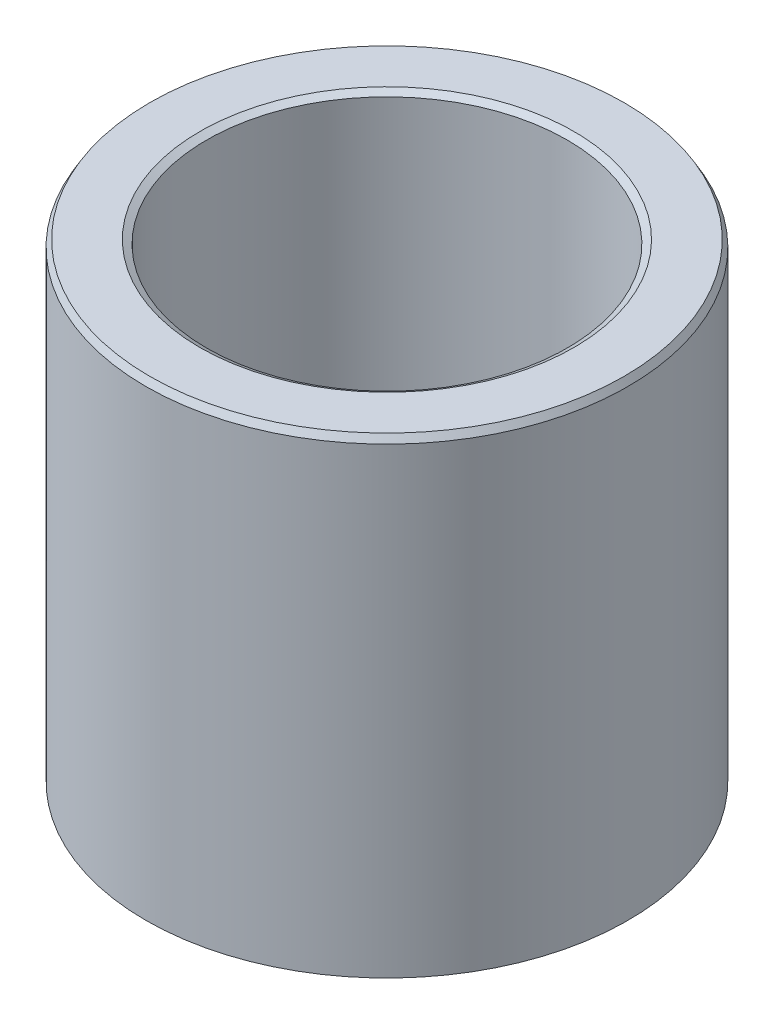
ISO-10303-21;
HEADER;
FILE_DESCRIPTION(('STEP AP214'),'2;1');
FILE_NAME('part.step','',(''),(''),'','','');
FILE_SCHEMA(('AUTOMOTIVE_DESIGN { 1 0 10303 214 1 1 1 1 }'));
ENDSEC;
DATA;
#1=APPLICATION_CONTEXT('core data for automotive mechanical design processes');
#2=APPLICATION_PROTOCOL_DEFINITION('international standard','automotive_design',2000,#1);
#3=PRODUCT_CONTEXT('',#1,'mechanical');
#4=PRODUCT('Part','Part','',(#3));
#5=PRODUCT_RELATED_PRODUCT_CATEGORY('part','',(#4));
#6=PRODUCT_DEFINITION_FORMATION('','',#4);
#7=PRODUCT_DEFINITION_CONTEXT('part definition',#1,'design');
#8=PRODUCT_DEFINITION('design','',#6,#7);
#9=PRODUCT_DEFINITION_SHAPE('','',#8);
#10=(LENGTH_UNIT() NAMED_UNIT(*) SI_UNIT(.MILLI.,.METRE.));
#11=(NAMED_UNIT(*) PLANE_ANGLE_UNIT() SI_UNIT($,.RADIAN.));
#12=(NAMED_UNIT(*) SI_UNIT($,.STERADIAN.) SOLID_ANGLE_UNIT());
#13=UNCERTAINTY_MEASURE_WITH_UNIT(LENGTH_MEASURE(1.E-05),#10,'distance_accuracy_value','');
#14=(GEOMETRIC_REPRESENTATION_CONTEXT(3) GLOBAL_UNCERTAINTY_ASSIGNED_CONTEXT((#13)) GLOBAL_UNIT_ASSIGNED_CONTEXT((#10,
#11,#12)) REPRESENTATION_CONTEXT('',''));
#15=CARTESIAN_POINT('',(0.,0.,0.));
#16=DIRECTION('',(0.,0.,1.));
#17=DIRECTION('',(1.,0.,0.));
#18=AXIS2_PLACEMENT_3D('',#15,#16,#17);
#19=CARTESIAN_POINT('',(0.,103.034649101545,0.));
#20=DIRECTION('',(0.,-1.,0.));
#21=DIRECTION('',(0.,0.,-1.));
#22=AXIS2_PLACEMENT_3D('',#19,#20,#21);
#23=CYLINDRICAL_SURFACE('',#22,52.5);
#24=CARTESIAN_POINT('',(0.,0.855837844820295,0.));
#25=DIRECTION('',(0.,1.,0.));
#26=DIRECTION('',(0.,0.,1.));
#27=AXIS2_PLACEMENT_3D('',#24,#25,#26);
#28=CIRCLE('',#27,52.5);
#29=CARTESIAN_POINT('',(0.,0.855837844820295,52.5));
#30=VERTEX_POINT('',#29);
#31=EDGE_CURVE('E10',#30,#30,#28,.T.);
#32=ORIENTED_EDGE('',*,*,#31,.T.);
#33=EDGE_LOOP('',(#32));
#34=FACE_BOUND('',#33,.T.);
#35=CARTESIAN_POINT('',(0.,101.552294471276,0.));
#36=DIRECTION('',(0.,1.,0.));
#37=DIRECTION('',(0.,0.,1.));
#38=AXIS2_PLACEMENT_3D('',#35,#36,#37);
#39=CIRCLE('',#38,52.5);
#40=CARTESIAN_POINT('',(0.,101.552294471276,52.5));
#41=VERTEX_POINT('',#40);
#42=EDGE_CURVE('E50',#41,#41,#39,.F.);
#43=ORIENTED_EDGE('',*,*,#42,.T.);
#44=EDGE_LOOP('',(#43));
#45=FACE_BOUND('',#44,.T.);
#46=ADVANCED_FACE('F39',(#34,#45),#23,.T.);
#47=CARTESIAN_POINT('',(0.,103.034649101545,0.));
#48=DIRECTION('',(0.,1.,0.));
#49=DIRECTION('',(0.,0.,1.));
#50=AXIS2_PLACEMENT_3D('',#47,#48,#49);
#51=PLANE('',#50);
#52=CARTESIAN_POINT('',(0.,103.034649101545,0.));
#53=DIRECTION('',(0.,1.,0.));
#54=DIRECTION('',(0.,0.,1.));
#55=AXIS2_PLACEMENT_3D('',#52,#53,#54);
#56=CIRCLE('',#55,40.7467712901323);
#57=CARTESIAN_POINT('',(0.,103.034649101545,40.7467712901323));
#58=VERTEX_POINT('',#57);
#59=EDGE_CURVE('E58',#58,#58,#56,.F.);
#60=ORIENTED_EDGE('',*,*,#59,.T.);
#61=EDGE_LOOP('',(#60));
#62=FACE_BOUND('',#61,.T.);
#63=CARTESIAN_POINT('',(0.,103.034649101545,0.));
#64=DIRECTION('',(0.,1.,0.));
#65=DIRECTION('',(0.,0.,1.));
#66=AXIS2_PLACEMENT_3D('',#63,#64,#65);
#67=CIRCLE('',#66,51.6441621551797);
#68=CARTESIAN_POINT('',(0.,103.034649101545,51.6441621551797));
#69=VERTEX_POINT('',#68);
#70=EDGE_CURVE('E61',#69,#69,#67,.T.);
#71=ORIENTED_EDGE('',*,*,#70,.T.);
#72=EDGE_LOOP('',(#71));
#73=FACE_BOUND('',#72,.T.);
#74=ADVANCED_FACE('F88',(#62,#73),#51,.T.);
#75=CARTESIAN_POINT('',(0.,0.,0.));
#76=DIRECTION('',(0.,1.,0.));
#77=DIRECTION('',(0.,0.,1.));
#78=AXIS2_PLACEMENT_3D('',#75,#76,#77);
#79=PLANE('',#78);
#80=CARTESIAN_POINT('',(0.,0.,0.));
#81=DIRECTION('',(0.,1.,0.));
#82=DIRECTION('',(0.,0.,1.));
#83=AXIS2_PLACEMENT_3D('',#80,#81,#82);
#84=CIRCLE('',#83,40.1202545046836);
#85=CARTESIAN_POINT('',(0.,0.,40.1202545046836));
#86=VERTEX_POINT('',#85);
#87=EDGE_CURVE('E51',#86,#86,#84,.T.);
#88=ORIENTED_EDGE('',*,*,#87,.T.);
#89=EDGE_LOOP('',(#88));
#90=FACE_BOUND('',#89,.T.);
#91=CARTESIAN_POINT('',(0.,0.,0.));
#92=DIRECTION('',(0.,1.,0.));
#93=DIRECTION('',(0.,0.,1.));
#94=AXIS2_PLACEMENT_3D('',#91,#92,#93);
#95=CIRCLE('',#94,51.017645369731);
#96=CARTESIAN_POINT('',(0.,0.,51.017645369731));
#97=VERTEX_POINT('',#96);
#98=EDGE_CURVE('E54',#97,#97,#95,.F.);
#99=ORIENTED_EDGE('',*,*,#98,.T.);
#100=EDGE_LOOP('',(#99));
#101=FACE_BOUND('',#100,.T.);
#102=ADVANCED_FACE('F83',(#90,#101),#79,.F.);
#103=CARTESIAN_POINT('',(0.,103.034649101545,0.));
#104=DIRECTION('',(0.,-1.,0.));
#105=DIRECTION('',(0.,0.,-1.));
#106=AXIS2_PLACEMENT_3D('',#103,#104,#105);
#107=CYLINDRICAL_SURFACE('',#106,39.2644166598634);
#108=CARTESIAN_POINT('',(0.,102.178811256725,0.));
#109=DIRECTION('',(0.,1.,0.));
#110=DIRECTION('',(0.,0.,1.));
#111=AXIS2_PLACEMENT_3D('',#108,#109,#110);
#112=CIRCLE('',#111,39.2644166598634);
#113=CARTESIAN_POINT('',(0.,102.178811256725,39.2644166598634));
#114=VERTEX_POINT('',#113);
#115=EDGE_CURVE('E67',#114,#114,#112,.T.);
#116=ORIENTED_EDGE('',*,*,#115,.T.);
#117=EDGE_LOOP('',(#116));
#118=FACE_BOUND('',#117,.T.);
#119=CARTESIAN_POINT('',(0.,1.48235463026898,0.));
#120=DIRECTION('',(0.,1.,0.));
#121=DIRECTION('',(0.,0.,1.));
#122=AXIS2_PLACEMENT_3D('',#119,#120,#121);
#123=CIRCLE('',#122,39.2644166598634);
#124=CARTESIAN_POINT('',(0.,1.48235463026898,39.2644166598634));
#125=VERTEX_POINT('',#124);
#126=EDGE_CURVE('E69',#125,#125,#123,.F.);
#127=ORIENTED_EDGE('',*,*,#126,.T.);
#128=EDGE_LOOP('',(#127));
#129=FACE_BOUND('',#128,.T.);
#130=ADVANCED_FACE('F71',(#118,#129),#107,.F.);
#131=CARTESIAN_POINT('',(0.,102.178811256725,0.));
#132=DIRECTION('',(0.,1.,0.));
#133=DIRECTION('',(0.,0.,1.));
#134=AXIS2_PLACEMENT_3D('',#131,#132,#133);
#135=CONICAL_SURFACE('',#134,39.2644166598634,1.0471975511966);
#136=ORIENTED_EDGE('',*,*,#59,.F.);
#137=EDGE_LOOP('',(#136));
#138=FACE_BOUND('',#137,.T.);
#139=ORIENTED_EDGE('',*,*,#115,.F.);
#140=EDGE_LOOP('',(#139));
#141=FACE_BOUND('',#140,.T.);
#142=ADVANCED_FACE('F77',(#138,#141),#135,.F.);
#143=CARTESIAN_POINT('',(0.,0.,0.));
#144=DIRECTION('',(0.,-1.,0.));
#145=DIRECTION('',(0.,0.,-1.));
#146=AXIS2_PLACEMENT_3D('',#143,#144,#145);
#147=CONICAL_SURFACE('',#146,40.1202545046836,0.523598775598294);
#148=ORIENTED_EDGE('',*,*,#126,.F.);
#149=EDGE_LOOP('',(#148));
#150=FACE_BOUND('',#149,.T.);
#151=ORIENTED_EDGE('',*,*,#87,.F.);
#152=EDGE_LOOP('',(#151));
#153=FACE_BOUND('',#152,.T.);
#154=ADVANCED_FACE('F73',(#150,#153),#147,.F.);
#155=CARTESIAN_POINT('',(0.,0.855837844820295,0.));
#156=DIRECTION('',(0.,1.,0.));
#157=DIRECTION('',(0.,0.,1.));
#158=AXIS2_PLACEMENT_3D('',#155,#156,#157);
#159=CONICAL_SURFACE('',#158,52.5,1.0471975511966);
#160=CARTESIAN_POINT('',(0.,0.,51.017645369731));
#161=CARTESIAN_POINT('',(0.,0.00891497755021294,51.0330865637963));
#162=CARTESIAN_POINT('',(0.,0.0178299551004238,51.0485277578616));
#163=CARTESIAN_POINT('',(0.,0.0356599102008455,51.0794101459922));
#164=CARTESIAN_POINT('',(0.,0.0445748877510563,51.0948513400575));
#165=CARTESIAN_POINT('',(0.,0.0624048428514794,51.1257337281881));
#166=CARTESIAN_POINT('',(0.,0.0713198204016916,51.1411749222534));
#167=CARTESIAN_POINT('',(0.,0.0891497755021145,51.172057310384));
#168=CARTESIAN_POINT('',(0.,0.0980647530523251,51.1874985044493));
#169=CARTESIAN_POINT('',(0.,0.115894708152747,51.2183808925799));
#170=CARTESIAN_POINT('',(0.,0.124809685702959,51.2338220866452));
#171=CARTESIAN_POINT('',(0.,0.142639640803383,51.2647044747758));
#172=CARTESIAN_POINT('',(0.,0.151554618353595,51.2801456688411));
#173=CARTESIAN_POINT('',(0.,0.169384573454017,51.3110280569717));
#174=CARTESIAN_POINT('',(0.,0.178299551004228,51.326469251037));
#175=CARTESIAN_POINT('',(0.,0.19612950610465,51.3573516391676));
#176=CARTESIAN_POINT('',(0.,0.205044483654863,51.3727928332329));
#177=CARTESIAN_POINT('',(0.,0.222874438755286,51.4036752213635));
#178=CARTESIAN_POINT('',(0.,0.231789416305496,51.4191164154289));
#179=CARTESIAN_POINT('',(0.,0.249619371405919,51.4499988035595));
#180=CARTESIAN_POINT('',(0.,0.25853434895613,51.4654399976248));
#181=CARTESIAN_POINT('',(0.,0.276364304056554,51.4963223857554));
#182=CARTESIAN_POINT('',(0.,0.285279281606766,51.5117635798207));
#183=CARTESIAN_POINT('',(0.,0.303109236707188,51.5426459679513));
#184=CARTESIAN_POINT('',(0.,0.312024214257399,51.5580871620166));
#185=CARTESIAN_POINT('',(0.,0.329854169357822,51.5889695501472));
#186=CARTESIAN_POINT('',(0.,0.338769146908034,51.6044107442125));
#187=CARTESIAN_POINT('',(0.,0.356599102008457,51.6352931323431));
#188=CARTESIAN_POINT('',(0.,0.365514079558667,51.6507343264084));
#189=CARTESIAN_POINT('',(0.,0.38334403465909,51.681616714539));
#190=CARTESIAN_POINT('',(0.,0.392259012209302,51.6970579086043));
#191=CARTESIAN_POINT('',(0.,0.410088967309725,51.7279402967349));
#192=CARTESIAN_POINT('',(0.,0.419003944859937,51.7433814908002));
#193=CARTESIAN_POINT('',(0.,0.436833899960359,51.7742638789308));
#194=CARTESIAN_POINT('',(0.,0.44574887751057,51.7897050729961));
#195=CARTESIAN_POINT('',(0.,0.463578832610993,51.8205874611267));
#196=CARTESIAN_POINT('',(0.,0.472493810161205,51.836028655192));
#197=CARTESIAN_POINT('',(0.,0.490323765261628,51.8669110433226));
#198=CARTESIAN_POINT('',(0.,0.499238742811839,51.8823522373879));
#199=CARTESIAN_POINT('',(0.,0.517068697912261,51.9132346255185));
#200=CARTESIAN_POINT('',(0.,0.525983675462473,51.9286758195838));
#201=CARTESIAN_POINT('',(0.,0.543813630562896,51.9595582077144));
#202=CARTESIAN_POINT('',(0.,0.552728608113108,51.9749994017797));
#203=CARTESIAN_POINT('',(0.,0.57055856321353,52.0058817899103));
#204=CARTESIAN_POINT('',(0.,0.579473540763741,52.0213229839756));
#205=CARTESIAN_POINT('',(0.,0.597303495864164,52.0522053721062));
#206=CARTESIAN_POINT('',(0.,0.606218473414376,52.0676465661715));
#207=CARTESIAN_POINT('',(0.,0.624048428514799,52.0985289543021));
#208=CARTESIAN_POINT('',(0.,0.632963406065009,52.1139701483674));
#209=CARTESIAN_POINT('',(0.,0.650793361165432,52.144852536498));
#210=CARTESIAN_POINT('',(0.,0.659708338715645,52.1602937305633));
#211=CARTESIAN_POINT('',(0.,0.677538293816068,52.191176118694));
#212=CARTESIAN_POINT('',(0.,0.686453271366278,52.2066173127593));
#213=CARTESIAN_POINT('',(0.,0.7042832264667,52.2374997008899));
#214=CARTESIAN_POINT('',(0.,0.713198204016912,52.2529408949552));
#215=CARTESIAN_POINT('',(0.,0.731028159117336,52.2838232830858));
#216=CARTESIAN_POINT('',(0.,0.739943136667548,52.2992644771511));
#217=CARTESIAN_POINT('',(0.,0.75777309176797,52.3301468652817));
#218=CARTESIAN_POINT('',(0.,0.766688069318181,52.345588059347));
#219=CARTESIAN_POINT('',(0.,0.784518024418604,52.3764704474776));
#220=CARTESIAN_POINT('',(0.,0.793433001968816,52.3919116415429));
#221=CARTESIAN_POINT('',(0.,0.811262957069239,52.4227940296735));
#222=CARTESIAN_POINT('',(0.,0.82017793461945,52.4382352237388));
#223=CARTESIAN_POINT('',(0.,0.838007889719871,52.4691176118694));
#224=CARTESIAN_POINT('',(0.,0.846922867270082,52.4845588059347));
#225=CARTESIAN_POINT('',(0.,0.855837844820295,52.5));
#226=B_SPLINE_CURVE_WITH_KNOTS('',3,(#160,#161,#162,#163,#164,#165,#166,#167,#168,#169,#170,
#171,#172,#173,#174,#175,#176,#177,#178,#179,#180,#181,#182,#183,#184,#185,#186,#187,#188,#189,
#190,#191,#192,#193,#194,#195,#196,#197,#198,#199,#200,#201,#202,#203,#204,#205,#206,#207,#208,
#209,#210,#211,#212,#213,#214,#215,#216,#217,#218,#219,#220,#221,#222,#223,#224,#225),
.UNSPECIFIED.,.F.,.F.,(4,2,2,2,2,2,2,2,2,2,2,2,2,2,2,2,2,2,2,2,2,2,2,2,2,2,2,2,2,2,2,2,4),(0.,
0.0534898653012661,0.106979730602538,0.160469595903804,0.213959461205076,0.267449326506342,
0.320939191807608,0.374429057108881,0.427918922410147,0.481408787711419,0.534898653012685,
0.588388518313951,0.641878383615223,0.695368248916489,0.748858114217761,0.802347979519027,
0.855837844820293,0.909327710121565,0.962817575422831,1.0163074407241,1.06979730602537,
1.12328717132664,1.17677703662791,1.23026690192917,1.28375676723045,1.33724663253171,
1.39073649783298,1.44422636313425,1.49771622843552,1.55120609373679,1.60469595903805,
1.65818582433933,1.71167568964059),.UNSPECIFIED.);
#227=EDGE_CURVE('BSEAM76',#97,#30,#226,.T.);
#228=ORIENTED_EDGE('',*,*,#98,.F.);
#229=ORIENTED_EDGE('',*,*,#31,.F.);
#230=ORIENTED_EDGE('',*,*,#227,.T.);
#231=ORIENTED_EDGE('',*,*,#227,.F.);
#232=EDGE_LOOP('',(#228,#230,#229,#231));
#233=FACE_BOUND('',#232,.T.);
#234=ADVANCED_FACE('F76',(#233),#159,.T.);
#235=CARTESIAN_POINT('',(0.,103.034649101545,0.));
#236=DIRECTION('',(0.,-1.,0.));
#237=DIRECTION('',(0.,0.,-1.));
#238=AXIS2_PLACEMENT_3D('',#235,#236,#237);
#239=CONICAL_SURFACE('',#238,51.6441621551797,0.523598775598296);
#240=ORIENTED_EDGE('',*,*,#42,.F.);
#241=EDGE_LOOP('',(#240));
#242=FACE_BOUND('',#241,.T.);
#243=ORIENTED_EDGE('',*,*,#70,.F.);
#244=EDGE_LOOP('',(#243));
#245=FACE_BOUND('',#244,.T.);
#246=ADVANCED_FACE('F45',(#242,#245),#239,.T.);
#247=CLOSED_SHELL('',(#46,#74,#102,#130,#142,#154,#234,#246));
#248=MANIFOLD_SOLID_BREP('B2',#247);
#249=ADVANCED_BREP_SHAPE_REPRESENTATION('',(#18,#248),#14);
#250=SHAPE_DEFINITION_REPRESENTATION(#9,#249);
ENDSEC;
END-ISO-10303-21;
